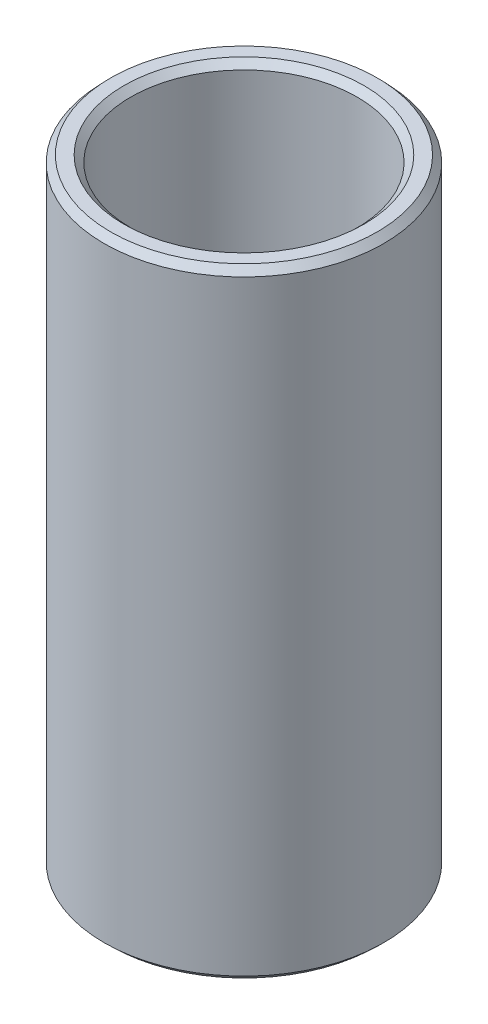
ISO-10303-21;
HEADER;
FILE_DESCRIPTION(('STEP AP214'),'2;1');
FILE_NAME('part.step','',(''),(''),'','','');
FILE_SCHEMA(('AUTOMOTIVE_DESIGN { 1 0 10303 214 1 1 1 1 }'));
ENDSEC;
DATA;
#1=APPLICATION_CONTEXT('core data for automotive mechanical design processes');
#2=APPLICATION_PROTOCOL_DEFINITION('international standard','automotive_design',2000,#1);
#3=PRODUCT_CONTEXT('',#1,'mechanical');
#4=PRODUCT('Part','Part','',(#3));
#5=PRODUCT_RELATED_PRODUCT_CATEGORY('part','',(#4));
#6=PRODUCT_DEFINITION_FORMATION('','',#4);
#7=PRODUCT_DEFINITION_CONTEXT('part definition',#1,'design');
#8=PRODUCT_DEFINITION('design','',#6,#7);
#9=PRODUCT_DEFINITION_SHAPE('','',#8);
#10=(LENGTH_UNIT() NAMED_UNIT(*) SI_UNIT(.MILLI.,.METRE.));
#11=(NAMED_UNIT(*) PLANE_ANGLE_UNIT() SI_UNIT($,.RADIAN.));
#12=(NAMED_UNIT(*) SI_UNIT($,.STERADIAN.) SOLID_ANGLE_UNIT());
#13=UNCERTAINTY_MEASURE_WITH_UNIT(LENGTH_MEASURE(1.E-05),#10,'distance_accuracy_value','');
#14=(GEOMETRIC_REPRESENTATION_CONTEXT(3) GLOBAL_UNCERTAINTY_ASSIGNED_CONTEXT((#13)) GLOBAL_UNIT_ASSIGNED_CONTEXT((#10,
#11,#12)) REPRESENTATION_CONTEXT('',''));
#15=CARTESIAN_POINT('',(0.,0.,0.));
#16=DIRECTION('',(0.,0.,1.));
#17=DIRECTION('',(1.,0.,0.));
#18=AXIS2_PLACEMENT_3D('',#15,#16,#17);
#19=CARTESIAN_POINT('',(0.,188.040535067989,0.));
#20=DIRECTION('',(0.,-1.,0.));
#21=DIRECTION('',(0.,0.,-1.));
#22=AXIS2_PLACEMENT_3D('',#19,#20,#21);
#23=CYLINDRICAL_SURFACE('',#22,42.5);
#24=CARTESIAN_POINT('',(0.,1.97315370528639,0.));
#25=DIRECTION('',(0.,1.,0.));
#26=DIRECTION('',(0.,0.,1.));
#27=AXIS2_PLACEMENT_3D('',#24,#25,#26);
#28=CIRCLE('',#27,42.5);
#29=CARTESIAN_POINT('',(0.,1.97315370528639,42.5));
#30=VERTEX_POINT('',#29);
#31=EDGE_CURVE('E10',#30,#30,#28,.T.);
#32=ORIENTED_EDGE('',*,*,#31,.T.);
#33=EDGE_LOOP('',(#32));
#34=FACE_BOUND('',#33,.T.);
#35=CARTESIAN_POINT('',(0.,185.958393626132,0.));
#36=DIRECTION('',(0.,1.,0.));
#37=DIRECTION('',(0.,0.,1.));
#38=AXIS2_PLACEMENT_3D('',#35,#36,#37);
#39=CIRCLE('',#38,42.5);
#40=CARTESIAN_POINT('',(0.,185.958393626132,42.5));
#41=VERTEX_POINT('',#40);
#42=EDGE_CURVE('E50',#41,#41,#39,.F.);
#43=ORIENTED_EDGE('',*,*,#42,.T.);
#44=EDGE_LOOP('',(#43));
#45=FACE_BOUND('',#44,.T.);
#46=ADVANCED_FACE('F39',(#34,#45),#23,.T.);
#47=CARTESIAN_POINT('',(0.,188.040535067989,0.));
#48=DIRECTION('',(0.,1.,0.));
#49=DIRECTION('',(0.,0.,1.));
#50=AXIS2_PLACEMENT_3D('',#47,#48,#49);
#51=PLANE('',#50);
#52=CARTESIAN_POINT('',(0.,188.040535067989,0.));
#53=DIRECTION('',(0.,1.,0.));
#54=DIRECTION('',(0.,0.,1.));
#55=AXIS2_PLACEMENT_3D('',#52,#53,#54);
#56=CIRCLE('',#55,36.4930883824497);
#57=CARTESIAN_POINT('',(0.,188.040535067989,36.4930883824497));
#58=VERTEX_POINT('',#57);
#59=EDGE_CURVE('E58',#58,#58,#56,.F.);
#60=ORIENTED_EDGE('',*,*,#59,.T.);
#61=EDGE_LOOP('',(#60));
#62=FACE_BOUND('',#61,.T.);
#63=CARTESIAN_POINT('',(0.,188.040535067989,0.));
#64=DIRECTION('',(0.,1.,0.));
#65=DIRECTION('',(0.,0.,1.));
#66=AXIS2_PLACEMENT_3D('',#63,#64,#65);
#67=CIRCLE('',#66,40.5268462947137);
#68=CARTESIAN_POINT('',(0.,188.040535067989,40.5268462947137));
#69=VERTEX_POINT('',#68);
#70=EDGE_CURVE('E61',#69,#69,#67,.T.);
#71=ORIENTED_EDGE('',*,*,#70,.T.);
#72=EDGE_LOOP('',(#71));
#73=FACE_BOUND('',#72,.T.);
#74=ADVANCED_FACE('F88',(#62,#73),#51,.T.);
#75=CARTESIAN_POINT('',(0.,0.,0.));
#76=DIRECTION('',(0.,1.,0.));
#77=DIRECTION('',(0.,0.,1.));
#78=AXIS2_PLACEMENT_3D('',#75,#76,#77);
#79=PLANE('',#78);
#80=CARTESIAN_POINT('',(0.,0.,0.));
#81=DIRECTION('',(0.,1.,0.));
#82=DIRECTION('',(0.,0.,1.));
#83=AXIS2_PLACEMENT_3D('',#80,#81,#82);
#84=CIRCLE('',#83,36.3841006458787);
#85=CARTESIAN_POINT('',(0.,0.,36.3841006458787));
#86=VERTEX_POINT('',#85);
#87=EDGE_CURVE('E51',#86,#86,#84,.T.);
#88=ORIENTED_EDGE('',*,*,#87,.T.);
#89=EDGE_LOOP('',(#88));
#90=FACE_BOUND('',#89,.T.);
#91=CARTESIAN_POINT('',(0.,0.,0.));
#92=DIRECTION('',(0.,1.,0.));
#93=DIRECTION('',(0.,0.,1.));
#94=AXIS2_PLACEMENT_3D('',#91,#92,#93);
#95=CIRCLE('',#94,40.4178585581426);
#96=CARTESIAN_POINT('',(0.,0.,40.4178585581426));
#97=VERTEX_POINT('',#96);
#98=EDGE_CURVE('E54',#97,#97,#95,.F.);
#99=ORIENTED_EDGE('',*,*,#98,.T.);
#100=EDGE_LOOP('',(#99));
#101=FACE_BOUND('',#100,.T.);
#102=ADVANCED_FACE('F83',(#90,#101),#79,.F.);
#103=CARTESIAN_POINT('',(0.,188.040535067989,0.));
#104=DIRECTION('',(0.,-1.,0.));
#105=DIRECTION('',(0.,0.,-1.));
#106=AXIS2_PLACEMENT_3D('',#103,#104,#105);
#107=CYLINDRICAL_SURFACE('',#106,34.4109469405923);
#108=CARTESIAN_POINT('',(0.,186.067381362703,0.));
#109=DIRECTION('',(0.,1.,0.));
#110=DIRECTION('',(0.,0.,1.));
#111=AXIS2_PLACEMENT_3D('',#108,#109,#110);
#112=CIRCLE('',#111,34.4109469405923);
#113=CARTESIAN_POINT('',(0.,186.067381362703,34.4109469405923));
#114=VERTEX_POINT('',#113);
#115=EDGE_CURVE('E67',#114,#114,#112,.T.);
#116=ORIENTED_EDGE('',*,*,#115,.T.);
#117=EDGE_LOOP('',(#116));
#118=FACE_BOUND('',#117,.T.);
#119=CARTESIAN_POINT('',(0.,2.08214144185739,0.));
#120=DIRECTION('',(0.,1.,0.));
#121=DIRECTION('',(0.,0.,1.));
#122=AXIS2_PLACEMENT_3D('',#119,#120,#121);
#123=CIRCLE('',#122,34.4109469405923);
#124=CARTESIAN_POINT('',(0.,2.08214144185739,34.4109469405923));
#125=VERTEX_POINT('',#124);
#126=EDGE_CURVE('E69',#125,#125,#123,.F.);
#127=ORIENTED_EDGE('',*,*,#126,.T.);
#128=EDGE_LOOP('',(#127));
#129=FACE_BOUND('',#128,.T.);
#130=ADVANCED_FACE('F71',(#118,#129),#107,.F.);
#131=CARTESIAN_POINT('',(0.,186.067381362703,0.));
#132=DIRECTION('',(0.,1.,0.));
#133=DIRECTION('',(0.,0.,1.));
#134=AXIS2_PLACEMENT_3D('',#131,#132,#133);
#135=CONICAL_SURFACE('',#134,34.4109469405923,0.812267109752612);
#136=ORIENTED_EDGE('',*,*,#59,.F.);
#137=EDGE_LOOP('',(#136));
#138=FACE_BOUND('',#137,.T.);
#139=ORIENTED_EDGE('',*,*,#115,.F.);
#140=EDGE_LOOP('',(#139));
#141=FACE_BOUND('',#140,.T.);
#142=ADVANCED_FACE('F77',(#138,#141),#135,.F.);
#143=CARTESIAN_POINT('',(0.,0.,0.));
#144=DIRECTION('',(0.,-1.,0.));
#145=DIRECTION('',(0.,0.,-1.));
#146=AXIS2_PLACEMENT_3D('',#143,#144,#145);
#147=CONICAL_SURFACE('',#146,36.3841006458787,0.758529217042278);
#148=ORIENTED_EDGE('',*,*,#126,.F.);
#149=EDGE_LOOP('',(#148));
#150=FACE_BOUND('',#149,.T.);
#151=ORIENTED_EDGE('',*,*,#87,.F.);
#152=EDGE_LOOP('',(#151));
#153=FACE_BOUND('',#152,.T.);
#154=ADVANCED_FACE('F73',(#150,#153),#147,.F.);
#155=CARTESIAN_POINT('',(0.,1.97315370528639,0.));
#156=DIRECTION('',(0.,1.,0.));
#157=DIRECTION('',(0.,0.,1.));
#158=AXIS2_PLACEMENT_3D('',#155,#156,#157);
#159=CONICAL_SURFACE('',#158,42.5,0.812267109752617);
#160=ORIENTED_EDGE('',*,*,#98,.F.);
#161=EDGE_LOOP('',(#160));
#162=FACE_BOUND('',#161,.T.);
#163=ORIENTED_EDGE('',*,*,#31,.F.);
#164=EDGE_LOOP('',(#163));
#165=FACE_BOUND('',#164,.T.);
#166=ADVANCED_FACE('F76',(#162,#165),#159,.T.);
#167=CARTESIAN_POINT('',(0.,188.040535067989,0.));
#168=DIRECTION('',(0.,-1.,0.));
#169=DIRECTION('',(0.,0.,-1.));
#170=AXIS2_PLACEMENT_3D('',#167,#168,#169);
#171=CONICAL_SURFACE('',#170,40.5268462947137,0.758529217042272);
#172=ORIENTED_EDGE('',*,*,#42,.F.);
#173=EDGE_LOOP('',(#172));
#174=FACE_BOUND('',#173,.T.);
#175=ORIENTED_EDGE('',*,*,#70,.F.);
#176=EDGE_LOOP('',(#175));
#177=FACE_BOUND('',#176,.T.);
#178=ADVANCED_FACE('F45',(#174,#177),#171,.T.);
#179=CLOSED_SHELL('',(#46,#74,#102,#130,#142,#154,#166,#178));
#180=MANIFOLD_SOLID_BREP('B2',#179);
#181=ADVANCED_BREP_SHAPE_REPRESENTATION('',(#18,#180),#14);
#182=SHAPE_DEFINITION_REPRESENTATION(#9,#181);
ENDSEC;
END-ISO-10303-21;
